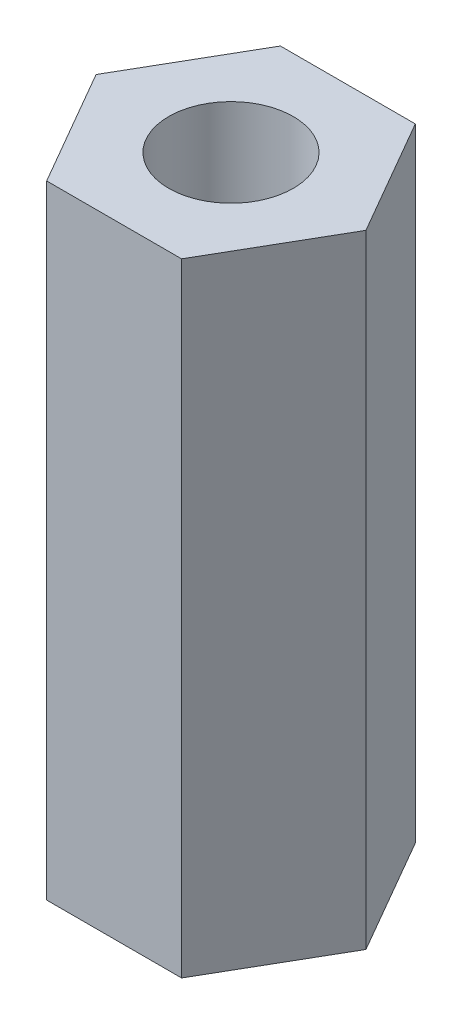
ISO-10303-21;
HEADER;
FILE_DESCRIPTION(('STEP AP214'),'2;1');
FILE_NAME('part.step','',(''),(''),'','','');
FILE_SCHEMA(('AUTOMOTIVE_DESIGN { 1 0 10303 214 1 1 1 1 }'));
ENDSEC;
DATA;
#1=APPLICATION_CONTEXT('core data for automotive mechanical design processes');
#2=APPLICATION_PROTOCOL_DEFINITION('international standard','automotive_design',2000,#1);
#3=PRODUCT_CONTEXT('',#1,'mechanical');
#4=PRODUCT('Part','Part','',(#3));
#5=PRODUCT_RELATED_PRODUCT_CATEGORY('part','',(#4));
#6=PRODUCT_DEFINITION_FORMATION('','',#4);
#7=PRODUCT_DEFINITION_CONTEXT('part definition',#1,'design');
#8=PRODUCT_DEFINITION('design','',#6,#7);
#9=PRODUCT_DEFINITION_SHAPE('','',#8);
#10=(LENGTH_UNIT() NAMED_UNIT(*) SI_UNIT(.MILLI.,.METRE.));
#11=(NAMED_UNIT(*) PLANE_ANGLE_UNIT() SI_UNIT($,.RADIAN.));
#12=(NAMED_UNIT(*) SI_UNIT($,.STERADIAN.) SOLID_ANGLE_UNIT());
#13=UNCERTAINTY_MEASURE_WITH_UNIT(LENGTH_MEASURE(1.E-05),#10,'distance_accuracy_value','');
#14=(GEOMETRIC_REPRESENTATION_CONTEXT(3) GLOBAL_UNCERTAINTY_ASSIGNED_CONTEXT((#13)) GLOBAL_UNIT_ASSIGNED_CONTEXT((#10,
#11,#12)) REPRESENTATION_CONTEXT('',''));
#15=CARTESIAN_POINT('',(0.,0.,0.));
#16=DIRECTION('',(0.,0.,1.));
#17=DIRECTION('',(1.,0.,0.));
#18=AXIS2_PLACEMENT_3D('',#15,#16,#17);
#19=CARTESIAN_POINT('',(0.,15.,0.));
#20=DIRECTION('',(0.,1.,0.));
#21=DIRECTION('',(0.,0.,1.));
#22=AXIS2_PLACEMENT_3D('',#19,#20,#21);
#23=PLANE('',#22);
#24=DIRECTION('',(-1.,0.,0.));
#25=VECTOR('',#24,1.);
#26=CARTESIAN_POINT('',(1.62499999999999,15.,-2.81458256229941));
#27=LINE('',#26,#25);
#28=CARTESIAN_POINT('',(1.62499999999999,15.,-2.81458256229941));
#29=VERTEX_POINT('',#28);
#30=CARTESIAN_POINT('',(-1.62499999999999,15.,-2.81458256229941));
#31=VERTEX_POINT('',#30);
#32=EDGE_CURVE('E133',#29,#31,#27,.T.);
#33=ORIENTED_EDGE('',*,*,#32,.T.);
#34=DIRECTION('',(-0.5,0.,0.866025403784439));
#35=VECTOR('',#34,1.);
#36=CARTESIAN_POINT('',(-1.62499999999999,15.,-2.81458256229941));
#37=LINE('',#36,#35);
#38=CARTESIAN_POINT('',(-3.24999999999998,15.,0.));
#39=VERTEX_POINT('',#38);
#40=EDGE_CURVE('E91',#31,#39,#37,.T.);
#41=ORIENTED_EDGE('',*,*,#40,.T.);
#42=DIRECTION('',(0.5,0.,0.866025403784439));
#43=VECTOR('',#42,1.);
#44=CARTESIAN_POINT('',(-3.24999999999998,15.,0.));
#45=LINE('',#44,#43);
#46=CARTESIAN_POINT('',(-1.62499999999999,15.,2.81458256229941));
#47=VERTEX_POINT('',#46);
#48=EDGE_CURVE('E104',#39,#47,#45,.T.);
#49=ORIENTED_EDGE('',*,*,#48,.T.);
#50=DIRECTION('',(1.,0.,0.));
#51=VECTOR('',#50,1.);
#52=CARTESIAN_POINT('',(-1.62499999999999,15.,2.81458256229941));
#53=LINE('',#52,#51);
#54=CARTESIAN_POINT('',(1.62499999999999,15.,2.81458256229941));
#55=VERTEX_POINT('',#54);
#56=EDGE_CURVE('E98',#47,#55,#53,.T.);
#57=ORIENTED_EDGE('',*,*,#56,.T.);
#58=DIRECTION('',(0.5,0.,-0.866025403784438));
#59=VECTOR('',#58,1.);
#60=CARTESIAN_POINT('',(1.62499999999999,15.,2.81458256229941));
#61=LINE('',#60,#59);
#62=CARTESIAN_POINT('',(3.24999999999999,15.,0.));
#63=VERTEX_POINT('',#62);
#64=EDGE_CURVE('E102',#55,#63,#61,.T.);
#65=ORIENTED_EDGE('',*,*,#64,.T.);
#66=DIRECTION('',(-0.5,0.,-0.866025403784439));
#67=VECTOR('',#66,1.);
#68=CARTESIAN_POINT('',(3.24999999999999,15.,0.));
#69=LINE('',#68,#67);
#70=EDGE_CURVE('E54',#63,#29,#69,.T.);
#71=ORIENTED_EDGE('',*,*,#70,.T.);
#72=EDGE_LOOP('',(#33,#41,#49,#57,#65,#71));
#73=FACE_BOUND('',#72,.T.);
#74=CARTESIAN_POINT('',(0.,15.,0.));
#75=DIRECTION('',(0.,1.,0.));
#76=DIRECTION('',(0.,0.,1.));
#77=AXIS2_PLACEMENT_3D('',#74,#75,#76);
#78=CIRCLE('',#77,1.5);
#79=CARTESIAN_POINT('',(0.,15.,1.5));
#80=VERTEX_POINT('',#79);
#81=EDGE_CURVE('E126',#80,#80,#78,.T.);
#82=ORIENTED_EDGE('',*,*,#81,.F.);
#83=EDGE_LOOP('',(#82));
#84=FACE_BOUND('',#83,.T.);
#85=ADVANCED_FACE('F37',(#73,#84),#23,.T.);
#86=CARTESIAN_POINT('',(0.,0.,0.));
#87=DIRECTION('',(0.,1.,0.));
#88=DIRECTION('',(0.,0.,1.));
#89=AXIS2_PLACEMENT_3D('',#86,#87,#88);
#90=PLANE('',#89);
#91=DIRECTION('',(-1.,0.,0.));
#92=VECTOR('',#91,1.);
#93=CARTESIAN_POINT('',(1.62499999999999,0.,-2.81458256229941));
#94=LINE('',#93,#92);
#95=CARTESIAN_POINT('',(1.62499999999999,0.,-2.81458256229941));
#96=VERTEX_POINT('',#95);
#97=CARTESIAN_POINT('',(-1.62499999999999,0.,-2.81458256229941));
#98=VERTEX_POINT('',#97);
#99=EDGE_CURVE('E122',#96,#98,#94,.T.);
#100=ORIENTED_EDGE('',*,*,#99,.F.);
#101=DIRECTION('',(-0.5,0.,-0.866025403784439));
#102=VECTOR('',#101,1.);
#103=CARTESIAN_POINT('',(3.24999999999999,0.,0.));
#104=LINE('',#103,#102);
#105=CARTESIAN_POINT('',(3.24999999999999,0.,0.));
#106=VERTEX_POINT('',#105);
#107=EDGE_CURVE('E83',#106,#96,#104,.T.);
#108=ORIENTED_EDGE('',*,*,#107,.F.);
#109=DIRECTION('',(0.5,0.,-0.866025403784438));
#110=VECTOR('',#109,1.);
#111=CARTESIAN_POINT('',(1.62499999999999,0.,2.81458256229941));
#112=LINE('',#111,#110);
#113=CARTESIAN_POINT('',(1.62499999999999,0.,2.81458256229941));
#114=VERTEX_POINT('',#113);
#115=EDGE_CURVE('E77',#114,#106,#112,.T.);
#116=ORIENTED_EDGE('',*,*,#115,.F.);
#117=DIRECTION('',(1.,0.,0.));
#118=VECTOR('',#117,1.);
#119=CARTESIAN_POINT('',(-1.62499999999999,0.,2.81458256229941));
#120=LINE('',#119,#118);
#121=CARTESIAN_POINT('',(-1.62499999999999,0.,2.81458256229941));
#122=VERTEX_POINT('',#121);
#123=EDGE_CURVE('E112',#122,#114,#120,.T.);
#124=ORIENTED_EDGE('',*,*,#123,.F.);
#125=DIRECTION('',(0.5,0.,0.866025403784439));
#126=VECTOR('',#125,1.);
#127=CARTESIAN_POINT('',(-3.24999999999998,0.,0.));
#128=LINE('',#127,#126);
#129=CARTESIAN_POINT('',(-3.24999999999998,0.,0.));
#130=VERTEX_POINT('',#129);
#131=EDGE_CURVE('E128',#130,#122,#128,.T.);
#132=ORIENTED_EDGE('',*,*,#131,.F.);
#133=DIRECTION('',(-0.5,0.,0.866025403784439));
#134=VECTOR('',#133,1.);
#135=CARTESIAN_POINT('',(-1.62499999999999,0.,-2.81458256229941));
#136=LINE('',#135,#134);
#137=EDGE_CURVE('E125',#98,#130,#136,.T.);
#138=ORIENTED_EDGE('',*,*,#137,.F.);
#139=EDGE_LOOP('',(#100,#108,#116,#124,#132,#138));
#140=FACE_BOUND('',#139,.T.);
#141=CARTESIAN_POINT('',(0.,0.,0.));
#142=DIRECTION('',(0.,1.,0.));
#143=DIRECTION('',(0.,0.,1.));
#144=AXIS2_PLACEMENT_3D('',#141,#142,#143);
#145=CIRCLE('',#144,1.5);
#146=CARTESIAN_POINT('',(0.,0.,1.5));
#147=VERTEX_POINT('',#146);
#148=EDGE_CURVE('E226',#147,#147,#145,.T.);
#149=ORIENTED_EDGE('',*,*,#148,.T.);
#150=EDGE_LOOP('',(#149));
#151=FACE_BOUND('',#150,.T.);
#152=ADVANCED_FACE('F142',(#140,#151),#90,.F.);
#153=CARTESIAN_POINT('',(1.62499999999999,15.,-2.81458256229941));
#154=DIRECTION('',(0.,0.,1.));
#155=DIRECTION('',(1.,0.,0.));
#156=AXIS2_PLACEMENT_3D('',#153,#154,#155);
#157=PLANE('',#156);
#158=ORIENTED_EDGE('',*,*,#99,.T.);
#159=DIRECTION('',(0.,-1.,0.));
#160=VECTOR('',#159,1.);
#161=CARTESIAN_POINT('',(-1.62499999999999,15.,-2.81458256229941));
#162=LINE('',#161,#160);
#163=EDGE_CURVE('E11',#31,#98,#162,.T.);
#164=ORIENTED_EDGE('',*,*,#163,.F.);
#165=ORIENTED_EDGE('',*,*,#32,.F.);
#166=DIRECTION('',(0.,-1.,0.));
#167=VECTOR('',#166,1.);
#168=CARTESIAN_POINT('',(1.62499999999999,15.,-2.81458256229941));
#169=LINE('',#168,#167);
#170=EDGE_CURVE('E118',#29,#96,#169,.T.);
#171=ORIENTED_EDGE('',*,*,#170,.T.);
#172=EDGE_LOOP('',(#158,#164,#165,#171));
#173=FACE_BOUND('',#172,.T.);
#174=ADVANCED_FACE('F39',(#173),#157,.F.);
#175=CARTESIAN_POINT('',(-1.62499999999999,15.,-2.81458256229941));
#176=DIRECTION('',(0.866025403784439,0.,0.5));
#177=DIRECTION('',(0.5,0.,-0.866025403784439));
#178=AXIS2_PLACEMENT_3D('',#175,#176,#177);
#179=PLANE('',#178);
#180=ORIENTED_EDGE('',*,*,#137,.T.);
#181=DIRECTION('',(0.,-1.,0.));
#182=VECTOR('',#181,1.);
#183=CARTESIAN_POINT('',(-3.24999999999998,15.,0.));
#184=LINE('',#183,#182);
#185=EDGE_CURVE('E46',#39,#130,#184,.T.);
#186=ORIENTED_EDGE('',*,*,#185,.F.);
#187=ORIENTED_EDGE('',*,*,#40,.F.);
#188=ORIENTED_EDGE('',*,*,#163,.T.);
#189=EDGE_LOOP('',(#180,#186,#187,#188));
#190=FACE_BOUND('',#189,.T.);
#191=ADVANCED_FACE('F167',(#190),#179,.F.);
#192=CARTESIAN_POINT('',(-3.24999999999998,15.,0.));
#193=DIRECTION('',(0.866025403784439,0.,-0.5));
#194=DIRECTION('',(-0.5,0.,-0.866025403784439));
#195=AXIS2_PLACEMENT_3D('',#192,#193,#194);
#196=PLANE('',#195);
#197=ORIENTED_EDGE('',*,*,#131,.T.);
#198=DIRECTION('',(0.,-1.,0.));
#199=VECTOR('',#198,1.);
#200=CARTESIAN_POINT('',(-1.62499999999999,15.,2.81458256229941));
#201=LINE('',#200,#199);
#202=EDGE_CURVE('E113',#47,#122,#201,.T.);
#203=ORIENTED_EDGE('',*,*,#202,.F.);
#204=ORIENTED_EDGE('',*,*,#48,.F.);
#205=ORIENTED_EDGE('',*,*,#185,.T.);
#206=EDGE_LOOP('',(#197,#203,#204,#205));
#207=FACE_BOUND('',#206,.T.);
#208=ADVANCED_FACE('F139',(#207),#196,.F.);
#209=CARTESIAN_POINT('',(-1.62499999999999,15.,2.81458256229941));
#210=DIRECTION('',(0.,0.,-1.));
#211=DIRECTION('',(-1.,0.,0.));
#212=AXIS2_PLACEMENT_3D('',#209,#210,#211);
#213=PLANE('',#212);
#214=ORIENTED_EDGE('',*,*,#123,.T.);
#215=DIRECTION('',(0.,-1.,0.));
#216=VECTOR('',#215,1.);
#217=CARTESIAN_POINT('',(1.62499999999999,15.,2.81458256229941));
#218=LINE('',#217,#216);
#219=EDGE_CURVE('E109',#55,#114,#218,.T.);
#220=ORIENTED_EDGE('',*,*,#219,.F.);
#221=ORIENTED_EDGE('',*,*,#56,.F.);
#222=ORIENTED_EDGE('',*,*,#202,.T.);
#223=EDGE_LOOP('',(#214,#220,#221,#222));
#224=FACE_BOUND('',#223,.T.);
#225=ADVANCED_FACE('F110',(#224),#213,.F.);
#226=CARTESIAN_POINT('',(1.62499999999999,15.,2.81458256229941));
#227=DIRECTION('',(-0.866025403784438,0.,-0.5));
#228=DIRECTION('',(-0.5,0.,0.866025403784439));
#229=AXIS2_PLACEMENT_3D('',#226,#227,#228);
#230=PLANE('',#229);
#231=ORIENTED_EDGE('',*,*,#115,.T.);
#232=DIRECTION('',(0.,-1.,0.));
#233=VECTOR('',#232,1.);
#234=CARTESIAN_POINT('',(3.24999999999999,15.,0.));
#235=LINE('',#234,#233);
#236=EDGE_CURVE('E114',#63,#106,#235,.T.);
#237=ORIENTED_EDGE('',*,*,#236,.F.);
#238=ORIENTED_EDGE('',*,*,#64,.F.);
#239=ORIENTED_EDGE('',*,*,#219,.T.);
#240=EDGE_LOOP('',(#231,#237,#238,#239));
#241=FACE_BOUND('',#240,.T.);
#242=ADVANCED_FACE('F116',(#241),#230,.F.);
#243=CARTESIAN_POINT('',(3.24999999999999,15.,0.));
#244=DIRECTION('',(-0.866025403784439,0.,0.5));
#245=DIRECTION('',(0.5,0.,0.866025403784439));
#246=AXIS2_PLACEMENT_3D('',#243,#244,#245);
#247=PLANE('',#246);
#248=ORIENTED_EDGE('',*,*,#107,.T.);
#249=ORIENTED_EDGE('',*,*,#170,.F.);
#250=ORIENTED_EDGE('',*,*,#70,.F.);
#251=ORIENTED_EDGE('',*,*,#236,.T.);
#252=EDGE_LOOP('',(#248,#249,#250,#251));
#253=FACE_BOUND('',#252,.T.);
#254=ADVANCED_FACE('F147',(#253),#247,.F.);
#255=CARTESIAN_POINT('',(0.,15.,0.));
#256=DIRECTION('',(0.,-1.,0.));
#257=DIRECTION('',(0.,0.,-1.));
#258=AXIS2_PLACEMENT_3D('',#255,#256,#257);
#259=CYLINDRICAL_SURFACE('',#258,1.5);
#260=ORIENTED_EDGE('',*,*,#81,.T.);
#261=EDGE_LOOP('',(#260));
#262=FACE_BOUND('',#261,.T.);
#263=ORIENTED_EDGE('',*,*,#148,.F.);
#264=EDGE_LOOP('',(#263));
#265=FACE_BOUND('',#264,.T.);
#266=ADVANCED_FACE('F149',(#262,#265),#259,.F.);
#267=CLOSED_SHELL('',(#85,#152,#174,#191,#208,#225,#242,#254,#266));
#268=MANIFOLD_SOLID_BREP('B2',#267);
#269=ADVANCED_BREP_SHAPE_REPRESENTATION('',(#18,#268),#14);
#270=SHAPE_DEFINITION_REPRESENTATION(#9,#269);
ENDSEC;
END-ISO-10303-21;
